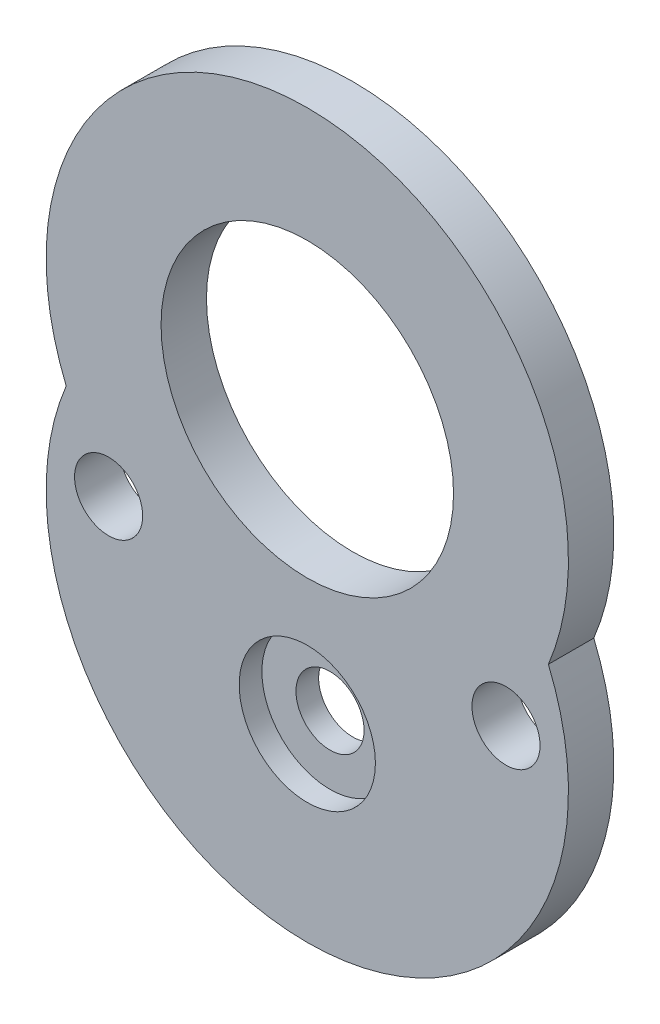
ISO-10303-21;
HEADER;
FILE_DESCRIPTION(('STEP AP214'),'2;1');
FILE_NAME('part.step','',(''),(''),'','','');
FILE_SCHEMA(('AUTOMOTIVE_DESIGN { 1 0 10303 214 1 1 1 1 }'));
ENDSEC;
DATA;
#1=APPLICATION_CONTEXT('core data for automotive mechanical design processes');
#2=APPLICATION_PROTOCOL_DEFINITION('international standard','automotive_design',2000,#1);
#3=PRODUCT_CONTEXT('',#1,'mechanical');
#4=PRODUCT('Part','Part','',(#3));
#5=PRODUCT_RELATED_PRODUCT_CATEGORY('part','',(#4));
#6=PRODUCT_DEFINITION_FORMATION('','',#4);
#7=PRODUCT_DEFINITION_CONTEXT('part definition',#1,'design');
#8=PRODUCT_DEFINITION('design','',#6,#7);
#9=PRODUCT_DEFINITION_SHAPE('','',#8);
#10=(LENGTH_UNIT() NAMED_UNIT(*) SI_UNIT(.MILLI.,.METRE.));
#11=(NAMED_UNIT(*) PLANE_ANGLE_UNIT() SI_UNIT($,.RADIAN.));
#12=(NAMED_UNIT(*) SI_UNIT($,.STERADIAN.) SOLID_ANGLE_UNIT());
#13=UNCERTAINTY_MEASURE_WITH_UNIT(LENGTH_MEASURE(1.E-05),#10,'distance_accuracy_value','');
#14=(GEOMETRIC_REPRESENTATION_CONTEXT(3) GLOBAL_UNCERTAINTY_ASSIGNED_CONTEXT((#13)) GLOBAL_UNIT_ASSIGNED_CONTEXT((#10,
#11,#12)) REPRESENTATION_CONTEXT('',''));
#15=CARTESIAN_POINT('',(0.,0.,0.));
#16=DIRECTION('',(0.,0.,1.));
#17=DIRECTION('',(1.,0.,0.));
#18=AXIS2_PLACEMENT_3D('',#15,#16,#17);
#19=CARTESIAN_POINT('',(0.,0.,2.));
#20=DIRECTION('',(0.,0.,1.));
#21=DIRECTION('',(1.,0.,0.));
#22=AXIS2_PLACEMENT_3D('',#19,#20,#21);
#23=PLANE('',#22);
#24=CARTESIAN_POINT('',(8.74999999999999,-7.7,2.));
#25=DIRECTION('',(0.,0.,1.));
#26=DIRECTION('',(1.,0.,0.));
#27=AXIS2_PLACEMENT_3D('',#24,#25,#26);
#28=CIRCLE('',#27,1.5);
#29=CARTESIAN_POINT('',(10.25,-7.7,2.));
#30=VERTEX_POINT('',#29);
#31=EDGE_CURVE('E12',#30,#30,#28,.T.);
#32=ORIENTED_EDGE('',*,*,#31,.F.);
#33=EDGE_LOOP('',(#32));
#34=FACE_BOUND('',#33,.T.);
#35=CARTESIAN_POINT('',(0.,0.,2.));
#36=DIRECTION('',(0.,0.,1.));
#37=DIRECTION('',(1.,0.,0.));
#38=AXIS2_PLACEMENT_3D('',#35,#36,#37);
#39=CIRCLE('',#38,6.44);
#40=CARTESIAN_POINT('',(6.44,0.,2.));
#41=VERTEX_POINT('',#40);
#42=EDGE_CURVE('E52',#41,#41,#39,.T.);
#43=ORIENTED_EDGE('',*,*,#42,.F.);
#44=EDGE_LOOP('',(#43));
#45=FACE_BOUND('',#44,.T.);
#46=CARTESIAN_POINT('',(-8.75000000000001,-7.7,2.));
#47=DIRECTION('',(0.,0.,1.));
#48=DIRECTION('',(1.,0.,0.));
#49=AXIS2_PLACEMENT_3D('',#46,#47,#48);
#50=CIRCLE('',#49,1.5);
#51=CARTESIAN_POINT('',(-7.25000000000001,-7.7,2.));
#52=VERTEX_POINT('',#51);
#53=EDGE_CURVE('E99',#52,#52,#50,.T.);
#54=ORIENTED_EDGE('',*,*,#53,.F.);
#55=EDGE_LOOP('',(#54));
#56=FACE_BOUND('',#55,.T.);
#57=CARTESIAN_POINT('',(0.,-12.,2.));
#58=DIRECTION('',(0.,0.,1.));
#59=DIRECTION('',(1.,0.,0.));
#60=AXIS2_PLACEMENT_3D('',#57,#58,#59);
#61=CIRCLE('',#60,3.);
#62=CARTESIAN_POINT('',(2.99999999999999,-12.,2.));
#63=VERTEX_POINT('',#62);
#64=EDGE_CURVE('E92',#63,#63,#61,.T.);
#65=ORIENTED_EDGE('',*,*,#64,.F.);
#66=EDGE_LOOP('',(#65));
#67=FACE_BOUND('',#66,.T.);
#68=CARTESIAN_POINT('',(0.,0.,2.));
#69=DIRECTION('',(0.,0.,1.));
#70=DIRECTION('',(1.,0.,0.));
#71=AXIS2_PLACEMENT_3D('',#68,#69,#70);
#72=CIRCLE('',#71,11.5);
#73=CARTESIAN_POINT('',(10.6169675519896,-4.41927595879687,2.));
#74=VERTEX_POINT('',#73);
#75=CARTESIAN_POINT('',(-10.6169675519896,-4.41927595879686,2.));
#76=VERTEX_POINT('',#75);
#77=EDGE_CURVE('E73',#74,#76,#72,.T.);
#78=ORIENTED_EDGE('',*,*,#77,.T.);
#79=CARTESIAN_POINT('',(0.,-8.83855191759374,2.));
#80=DIRECTION('',(0.,0.,1.));
#81=DIRECTION('',(1.,0.,0.));
#82=AXIS2_PLACEMENT_3D('',#79,#80,#81);
#83=CIRCLE('',#82,11.5);
#84=EDGE_CURVE('E60',#76,#74,#83,.T.);
#85=ORIENTED_EDGE('',*,*,#84,.T.);
#86=EDGE_LOOP('',(#78,#85));
#87=FACE_BOUND('',#86,.T.);
#88=ADVANCED_FACE('F43',(#34,#45,#56,#67,#87),#23,.T.);
#89=CARTESIAN_POINT('',(0.,0.,0.));
#90=DIRECTION('',(0.,0.,1.));
#91=DIRECTION('',(1.,0.,0.));
#92=AXIS2_PLACEMENT_3D('',#89,#90,#91);
#93=PLANE('',#92);
#94=CARTESIAN_POINT('',(0.,-12.,0.));
#95=DIRECTION('',(0.,0.,1.));
#96=DIRECTION('',(1.,0.,0.));
#97=AXIS2_PLACEMENT_3D('',#94,#95,#96);
#98=CIRCLE('',#97,1.5);
#99=CARTESIAN_POINT('',(1.49999999999999,-12.,0.));
#100=VERTEX_POINT('',#99);
#101=EDGE_CURVE('E47',#100,#100,#98,.T.);
#102=ORIENTED_EDGE('',*,*,#101,.T.);
#103=EDGE_LOOP('',(#102));
#104=FACE_BOUND('',#103,.T.);
#105=CARTESIAN_POINT('',(8.74999999999999,-7.7,0.));
#106=DIRECTION('',(0.,0.,1.));
#107=DIRECTION('',(1.,0.,0.));
#108=AXIS2_PLACEMENT_3D('',#105,#106,#107);
#109=CIRCLE('',#108,1.5);
#110=CARTESIAN_POINT('',(10.25,-7.7,0.));
#111=VERTEX_POINT('',#110);
#112=EDGE_CURVE('E108',#111,#111,#109,.T.);
#113=ORIENTED_EDGE('',*,*,#112,.T.);
#114=EDGE_LOOP('',(#113));
#115=FACE_BOUND('',#114,.T.);
#116=CARTESIAN_POINT('',(0.,0.,0.));
#117=DIRECTION('',(0.,0.,1.));
#118=DIRECTION('',(1.,0.,0.));
#119=AXIS2_PLACEMENT_3D('',#116,#117,#118);
#120=CIRCLE('',#119,6.44);
#121=CARTESIAN_POINT('',(6.44,0.,0.));
#122=VERTEX_POINT('',#121);
#123=EDGE_CURVE('E106',#122,#122,#120,.T.);
#124=ORIENTED_EDGE('',*,*,#123,.T.);
#125=EDGE_LOOP('',(#124));
#126=FACE_BOUND('',#125,.T.);
#127=CARTESIAN_POINT('',(-8.75000000000001,-7.7,0.));
#128=DIRECTION('',(0.,0.,1.));
#129=DIRECTION('',(1.,0.,0.));
#130=AXIS2_PLACEMENT_3D('',#127,#128,#129);
#131=CIRCLE('',#130,1.5);
#132=CARTESIAN_POINT('',(-7.25000000000001,-7.7,0.));
#133=VERTEX_POINT('',#132);
#134=EDGE_CURVE('E96',#133,#133,#131,.T.);
#135=ORIENTED_EDGE('',*,*,#134,.T.);
#136=EDGE_LOOP('',(#135));
#137=FACE_BOUND('',#136,.T.);
#138=CARTESIAN_POINT('',(0.,-8.83855191759374,0.));
#139=DIRECTION('',(0.,0.,1.));
#140=DIRECTION('',(1.,0.,0.));
#141=AXIS2_PLACEMENT_3D('',#138,#139,#140);
#142=CIRCLE('',#141,11.5);
#143=CARTESIAN_POINT('',(-10.6169675519896,-4.41927595879686,0.));
#144=VERTEX_POINT('',#143);
#145=CARTESIAN_POINT('',(10.6169675519896,-4.41927595879687,0.));
#146=VERTEX_POINT('',#145);
#147=EDGE_CURVE('E77',#144,#146,#142,.T.);
#148=ORIENTED_EDGE('',*,*,#147,.F.);
#149=CARTESIAN_POINT('',(0.,0.,0.));
#150=DIRECTION('',(0.,0.,1.));
#151=DIRECTION('',(1.,0.,0.));
#152=AXIS2_PLACEMENT_3D('',#149,#150,#151);
#153=CIRCLE('',#152,11.5);
#154=EDGE_CURVE('E86',#146,#144,#153,.T.);
#155=ORIENTED_EDGE('',*,*,#154,.F.);
#156=EDGE_LOOP('',(#148,#155));
#157=FACE_BOUND('',#156,.T.);
#158=ADVANCED_FACE('F115',(#104,#115,#126,#137,#157),#93,.F.);
#159=CARTESIAN_POINT('',(0.,-12.,2.));
#160=DIRECTION('',(0.,0.,-1.));
#161=DIRECTION('',(-1.,0.,0.));
#162=AXIS2_PLACEMENT_3D('',#159,#160,#161);
#163=CYLINDRICAL_SURFACE('',#162,1.5);
#164=ORIENTED_EDGE('',*,*,#101,.F.);
#165=EDGE_LOOP('',(#164));
#166=FACE_BOUND('',#165,.T.);
#167=CARTESIAN_POINT('',(0.,-12.,1.));
#168=DIRECTION('',(0.,0.,1.));
#169=DIRECTION('',(1.,0.,0.));
#170=AXIS2_PLACEMENT_3D('',#167,#168,#169);
#171=CIRCLE('',#170,1.5);
#172=CARTESIAN_POINT('',(1.49999999999999,-12.,1.));
#173=VERTEX_POINT('',#172);
#174=EDGE_CURVE('E82',#173,#173,#171,.T.);
#175=ORIENTED_EDGE('',*,*,#174,.T.);
#176=EDGE_LOOP('',(#175));
#177=FACE_BOUND('',#176,.T.);
#178=ADVANCED_FACE('F117',(#166,#177),#163,.F.);
#179=CARTESIAN_POINT('',(8.74999999999999,-7.7,2.));
#180=DIRECTION('',(0.,0.,-1.));
#181=DIRECTION('',(-1.,0.,0.));
#182=AXIS2_PLACEMENT_3D('',#179,#180,#181);
#183=CYLINDRICAL_SURFACE('',#182,1.5);
#184=ORIENTED_EDGE('',*,*,#31,.T.);
#185=EDGE_LOOP('',(#184));
#186=FACE_BOUND('',#185,.T.);
#187=ORIENTED_EDGE('',*,*,#112,.F.);
#188=EDGE_LOOP('',(#187));
#189=FACE_BOUND('',#188,.T.);
#190=ADVANCED_FACE('F120',(#186,#189),#183,.F.);
#191=CARTESIAN_POINT('',(0.,0.,2.));
#192=DIRECTION('',(0.,0.,-1.));
#193=DIRECTION('',(-1.,0.,0.));
#194=AXIS2_PLACEMENT_3D('',#191,#192,#193);
#195=CYLINDRICAL_SURFACE('',#194,6.44);
#196=ORIENTED_EDGE('',*,*,#42,.T.);
#197=EDGE_LOOP('',(#196));
#198=FACE_BOUND('',#197,.T.);
#199=ORIENTED_EDGE('',*,*,#123,.F.);
#200=EDGE_LOOP('',(#199));
#201=FACE_BOUND('',#200,.T.);
#202=ADVANCED_FACE('F147',(#198,#201),#195,.F.);
#203=CARTESIAN_POINT('',(-8.75000000000001,-7.7,2.));
#204=DIRECTION('',(0.,0.,-1.));
#205=DIRECTION('',(-1.,0.,0.));
#206=AXIS2_PLACEMENT_3D('',#203,#204,#205);
#207=CYLINDRICAL_SURFACE('',#206,1.5);
#208=ORIENTED_EDGE('',*,*,#53,.T.);
#209=EDGE_LOOP('',(#208));
#210=FACE_BOUND('',#209,.T.);
#211=ORIENTED_EDGE('',*,*,#134,.F.);
#212=EDGE_LOOP('',(#211));
#213=FACE_BOUND('',#212,.T.);
#214=ADVANCED_FACE('F45',(#210,#213),#207,.F.);
#215=CARTESIAN_POINT('',(0.,-12.,1.));
#216=DIRECTION('',(0.,0.,1.));
#217=DIRECTION('',(1.,0.,0.));
#218=AXIS2_PLACEMENT_3D('',#215,#216,#217);
#219=CYLINDRICAL_SURFACE('',#218,3.);
#220=CARTESIAN_POINT('',(0.,-12.,1.));
#221=DIRECTION('',(0.,0.,1.));
#222=DIRECTION('',(1.,0.,0.));
#223=AXIS2_PLACEMENT_3D('',#220,#221,#222);
#224=CIRCLE('',#223,3.);
#225=CARTESIAN_POINT('',(2.99999999999999,-12.,1.));
#226=VERTEX_POINT('',#225);
#227=EDGE_CURVE('E93',#226,#226,#224,.T.);
#228=ORIENTED_EDGE('',*,*,#227,.F.);
#229=EDGE_LOOP('',(#228));
#230=FACE_BOUND('',#229,.T.);
#231=ORIENTED_EDGE('',*,*,#64,.T.);
#232=EDGE_LOOP('',(#231));
#233=FACE_BOUND('',#232,.T.);
#234=ADVANCED_FACE('F127',(#230,#233),#219,.F.);
#235=CARTESIAN_POINT('',(0.,-12.,1.));
#236=DIRECTION('',(0.,0.,1.));
#237=DIRECTION('',(1.,0.,0.));
#238=AXIS2_PLACEMENT_3D('',#235,#236,#237);
#239=PLANE('',#238);
#240=ORIENTED_EDGE('',*,*,#174,.F.);
#241=EDGE_LOOP('',(#240));
#242=FACE_BOUND('',#241,.T.);
#243=ORIENTED_EDGE('',*,*,#227,.T.);
#244=EDGE_LOOP('',(#243));
#245=FACE_BOUND('',#244,.T.);
#246=ADVANCED_FACE('F124',(#242,#245),#239,.T.);
#247=CARTESIAN_POINT('',(0.,-8.83855191759374,0.));
#248=DIRECTION('',(0.,0.,1.));
#249=DIRECTION('',(1.,0.,0.));
#250=AXIS2_PLACEMENT_3D('',#247,#248,#249);
#251=CYLINDRICAL_SURFACE('',#250,11.5);
#252=ORIENTED_EDGE('',*,*,#84,.F.);
#253=DIRECTION('',(0.,0.,1.));
#254=VECTOR('',#253,1.);
#255=CARTESIAN_POINT('',(-10.6169675519896,-4.41927595879686,0.));
#256=LINE('',#255,#254);
#257=EDGE_CURVE('E75',#144,#76,#256,.T.);
#258=ORIENTED_EDGE('',*,*,#257,.F.);
#259=ORIENTED_EDGE('',*,*,#147,.T.);
#260=DIRECTION('',(0.,0.,1.));
#261=VECTOR('',#260,1.);
#262=CARTESIAN_POINT('',(10.6169675519896,-4.41927595879687,0.));
#263=LINE('',#262,#261);
#264=EDGE_CURVE('E67',#146,#74,#263,.T.);
#265=ORIENTED_EDGE('',*,*,#264,.T.);
#266=EDGE_LOOP('',(#252,#258,#259,#265));
#267=FACE_BOUND('',#266,.T.);
#268=ADVANCED_FACE('F79',(#267),#251,.T.);
#269=CARTESIAN_POINT('',(0.,0.,0.));
#270=DIRECTION('',(0.,0.,1.));
#271=DIRECTION('',(1.,0.,0.));
#272=AXIS2_PLACEMENT_3D('',#269,#270,#271);
#273=CYLINDRICAL_SURFACE('',#272,11.5);
#274=ORIENTED_EDGE('',*,*,#77,.F.);
#275=ORIENTED_EDGE('',*,*,#264,.F.);
#276=ORIENTED_EDGE('',*,*,#154,.T.);
#277=ORIENTED_EDGE('',*,*,#257,.T.);
#278=EDGE_LOOP('',(#274,#275,#276,#277));
#279=FACE_BOUND('',#278,.T.);
#280=ADVANCED_FACE('F74',(#279),#273,.T.);
#281=CLOSED_SHELL('',(#88,#158,#178,#190,#202,#214,#234,#246,#268,#280));
#282=MANIFOLD_SOLID_BREP('B2',#281);
#283=ADVANCED_BREP_SHAPE_REPRESENTATION('',(#18,#282),#14);
#284=SHAPE_DEFINITION_REPRESENTATION(#9,#283);
ENDSEC;
END-ISO-10303-21;
